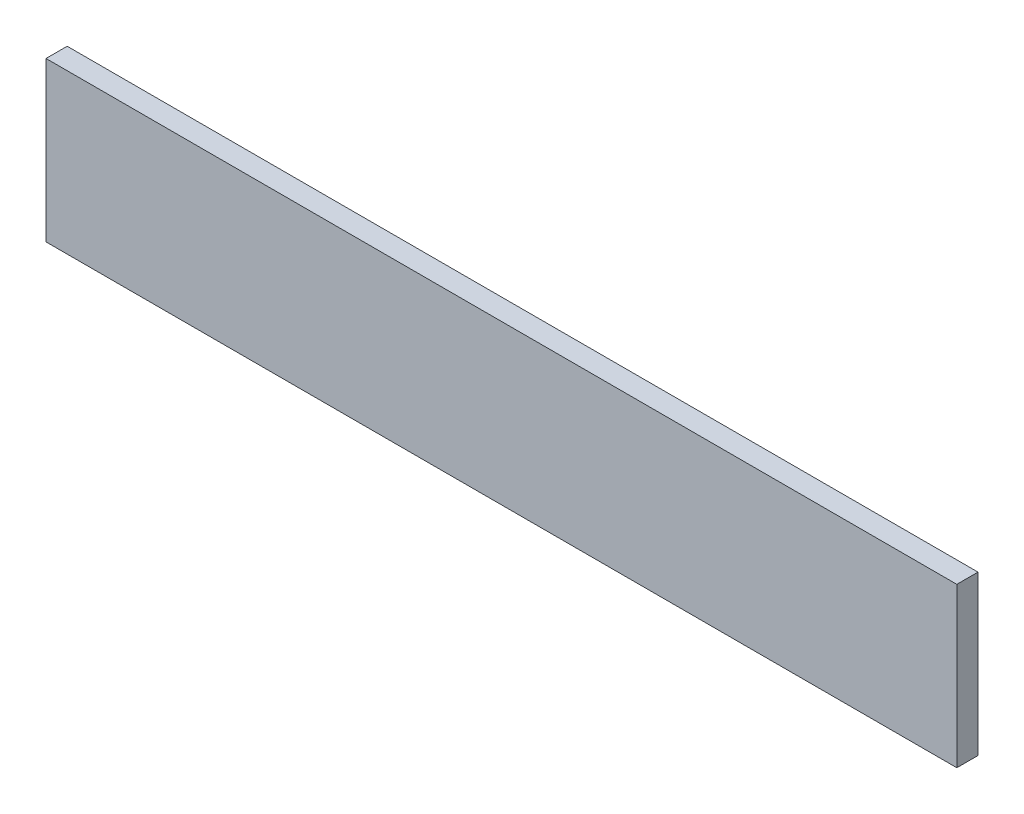
ISO-10303-21;
HEADER;
FILE_DESCRIPTION(('STEP AP214'),'2;1');
FILE_NAME('part.step','',(''),(''),'','','');
FILE_SCHEMA(('AUTOMOTIVE_DESIGN { 1 0 10303 214 1 1 1 1 }'));
ENDSEC;
DATA;
#1=APPLICATION_CONTEXT('core data for automotive mechanical design processes');
#2=APPLICATION_PROTOCOL_DEFINITION('international standard','automotive_design',2000,#1);
#3=PRODUCT_CONTEXT('',#1,'mechanical');
#4=PRODUCT('Part','Part','',(#3));
#5=PRODUCT_RELATED_PRODUCT_CATEGORY('part','',(#4));
#6=PRODUCT_DEFINITION_FORMATION('','',#4);
#7=PRODUCT_DEFINITION_CONTEXT('part definition',#1,'design');
#8=PRODUCT_DEFINITION('design','',#6,#7);
#9=PRODUCT_DEFINITION_SHAPE('','',#8);
#10=(LENGTH_UNIT() NAMED_UNIT(*) SI_UNIT(.MILLI.,.METRE.));
#11=(NAMED_UNIT(*) PLANE_ANGLE_UNIT() SI_UNIT($,.RADIAN.));
#12=(NAMED_UNIT(*) SI_UNIT($,.STERADIAN.) SOLID_ANGLE_UNIT());
#13=UNCERTAINTY_MEASURE_WITH_UNIT(LENGTH_MEASURE(1.E-05),#10,'distance_accuracy_value','');
#14=(GEOMETRIC_REPRESENTATION_CONTEXT(3) GLOBAL_UNCERTAINTY_ASSIGNED_CONTEXT((#13)) GLOBAL_UNIT_ASSIGNED_CONTEXT((#10,
#11,#12)) REPRESENTATION_CONTEXT('',''));
#15=CARTESIAN_POINT('',(0.,0.,0.));
#16=DIRECTION('',(0.,0.,1.));
#17=DIRECTION('',(1.,0.,0.));
#18=AXIS2_PLACEMENT_3D('',#15,#16,#17);
#19=CARTESIAN_POINT('',(-613.953092608063,236.823308270677,20.));
#20=DIRECTION('',(1.,0.,0.));
#21=DIRECTION('',(0.,0.,-1.));
#22=AXIS2_PLACEMENT_3D('',#19,#20,#21);
#23=PLANE('',#22);
#24=DIRECTION('',(0.,-1.,0.));
#25=VECTOR('',#24,1.);
#26=CARTESIAN_POINT('',(-613.953092608063,236.823308270677,0.));
#27=LINE('',#26,#25);
#28=CARTESIAN_POINT('',(-613.953092608063,236.823308270677,0.));
#29=VERTEX_POINT('',#28);
#30=CARTESIAN_POINT('',(-613.953092608063,86.8233082706766,0.));
#31=VERTEX_POINT('',#30);
#32=EDGE_CURVE('E96',#29,#31,#27,.T.);
#33=ORIENTED_EDGE('',*,*,#32,.T.);
#34=DIRECTION('',(0.,0.,-1.));
#35=VECTOR('',#34,1.);
#36=CARTESIAN_POINT('',(-613.953092608063,86.8233082706766,20.));
#37=LINE('',#36,#35);
#38=CARTESIAN_POINT('',(-613.953092608063,86.8233082706766,20.));
#39=VERTEX_POINT('',#38);
#40=EDGE_CURVE('E11',#39,#31,#37,.T.);
#41=ORIENTED_EDGE('',*,*,#40,.F.);
#42=DIRECTION('',(0.,-1.,0.));
#43=VECTOR('',#42,1.);
#44=CARTESIAN_POINT('',(-613.953092608063,236.823308270677,20.));
#45=LINE('',#44,#43);
#46=CARTESIAN_POINT('',(-613.953092608063,236.823308270677,20.));
#47=VERTEX_POINT('',#46);
#48=EDGE_CURVE('E84',#47,#39,#45,.T.);
#49=ORIENTED_EDGE('',*,*,#48,.F.);
#50=DIRECTION('',(0.,0.,-1.));
#51=VECTOR('',#50,1.);
#52=CARTESIAN_POINT('',(-613.953092608063,236.823308270677,20.));
#53=LINE('',#52,#51);
#54=EDGE_CURVE('E92',#47,#29,#53,.T.);
#55=ORIENTED_EDGE('',*,*,#54,.T.);
#56=EDGE_LOOP('',(#33,#41,#49,#55));
#57=FACE_BOUND('',#56,.T.);
#58=ADVANCED_FACE('F33',(#57),#23,.F.);
#59=CARTESIAN_POINT('',(-613.953092608063,86.8233082706766,20.));
#60=DIRECTION('',(0.,1.,0.));
#61=DIRECTION('',(0.,0.,1.));
#62=AXIS2_PLACEMENT_3D('',#59,#60,#61);
#63=PLANE('',#62);
#64=DIRECTION('',(1.,0.,0.));
#65=VECTOR('',#64,1.);
#66=CARTESIAN_POINT('',(-613.953092608063,86.8233082706766,0.));
#67=LINE('',#66,#65);
#68=CARTESIAN_POINT('',(246.046907391937,86.8233082706766,0.));
#69=VERTEX_POINT('',#68);
#70=EDGE_CURVE('E88',#31,#69,#67,.T.);
#71=ORIENTED_EDGE('',*,*,#70,.T.);
#72=DIRECTION('',(0.,0.,-1.));
#73=VECTOR('',#72,1.);
#74=CARTESIAN_POINT('',(246.046907391937,86.8233082706766,20.));
#75=LINE('',#74,#73);
#76=CARTESIAN_POINT('',(246.046907391937,86.8233082706766,20.));
#77=VERTEX_POINT('',#76);
#78=EDGE_CURVE('E41',#77,#69,#75,.T.);
#79=ORIENTED_EDGE('',*,*,#78,.F.);
#80=DIRECTION('',(1.,0.,0.));
#81=VECTOR('',#80,1.);
#82=CARTESIAN_POINT('',(-613.953092608063,86.8233082706766,20.));
#83=LINE('',#82,#81);
#84=EDGE_CURVE('E79',#39,#77,#83,.T.);
#85=ORIENTED_EDGE('',*,*,#84,.F.);
#86=ORIENTED_EDGE('',*,*,#40,.T.);
#87=EDGE_LOOP('',(#71,#79,#85,#86));
#88=FACE_BOUND('',#87,.T.);
#89=ADVANCED_FACE('F87',(#88),#63,.F.);
#90=CARTESIAN_POINT('',(246.046907391937,236.823308270677,20.));
#91=DIRECTION('',(-1.,0.,0.));
#92=DIRECTION('',(0.,-1.,0.));
#93=AXIS2_PLACEMENT_3D('',#90,#91,#92);
#94=PLANE('',#93);
#95=DIRECTION('',(0.,1.,0.));
#96=VECTOR('',#95,1.);
#97=CARTESIAN_POINT('',(246.046907391937,236.823308270677,0.));
#98=LINE('',#97,#96);
#99=CARTESIAN_POINT('',(246.046907391937,236.823308270677,0.));
#100=VERTEX_POINT('',#99);
#101=EDGE_CURVE('E66',#69,#100,#98,.T.);
#102=ORIENTED_EDGE('',*,*,#101,.T.);
#103=DIRECTION('',(0.,0.,-1.));
#104=VECTOR('',#103,1.);
#105=CARTESIAN_POINT('',(246.046907391937,236.823308270677,20.));
#106=LINE('',#105,#104);
#107=CARTESIAN_POINT('',(246.046907391937,236.823308270677,20.));
#108=VERTEX_POINT('',#107);
#109=EDGE_CURVE('E89',#108,#100,#106,.T.);
#110=ORIENTED_EDGE('',*,*,#109,.F.);
#111=DIRECTION('',(0.,1.,0.));
#112=VECTOR('',#111,1.);
#113=CARTESIAN_POINT('',(246.046907391937,236.823308270677,20.));
#114=LINE('',#113,#112);
#115=EDGE_CURVE('E82',#77,#108,#114,.T.);
#116=ORIENTED_EDGE('',*,*,#115,.F.);
#117=ORIENTED_EDGE('',*,*,#78,.T.);
#118=EDGE_LOOP('',(#102,#110,#116,#117));
#119=FACE_BOUND('',#118,.T.);
#120=ADVANCED_FACE('F90',(#119),#94,.F.);
#121=CARTESIAN_POINT('',(-613.953092608063,236.823308270677,20.));
#122=DIRECTION('',(0.,-1.,0.));
#123=DIRECTION('',(0.,0.,-1.));
#124=AXIS2_PLACEMENT_3D('',#121,#122,#123);
#125=PLANE('',#124);
#126=DIRECTION('',(-1.,0.,0.));
#127=VECTOR('',#126,1.);
#128=CARTESIAN_POINT('',(-613.953092608063,236.823308270677,0.));
#129=LINE('',#128,#127);
#130=EDGE_CURVE('E72',#100,#29,#129,.T.);
#131=ORIENTED_EDGE('',*,*,#130,.T.);
#132=ORIENTED_EDGE('',*,*,#54,.F.);
#133=DIRECTION('',(-1.,0.,0.));
#134=VECTOR('',#133,1.);
#135=CARTESIAN_POINT('',(-613.953092608063,236.823308270677,20.));
#136=LINE('',#135,#134);
#137=EDGE_CURVE('E49',#108,#47,#136,.T.);
#138=ORIENTED_EDGE('',*,*,#137,.F.);
#139=ORIENTED_EDGE('',*,*,#109,.T.);
#140=EDGE_LOOP('',(#131,#132,#138,#139));
#141=FACE_BOUND('',#140,.T.);
#142=ADVANCED_FACE('F103',(#141),#125,.F.);
#143=CARTESIAN_POINT('',(0.,0.,20.));
#144=DIRECTION('',(0.,0.,1.));
#145=DIRECTION('',(1.,0.,0.));
#146=AXIS2_PLACEMENT_3D('',#143,#144,#145);
#147=PLANE('',#146);
#148=ORIENTED_EDGE('',*,*,#48,.T.);
#149=ORIENTED_EDGE('',*,*,#84,.T.);
#150=ORIENTED_EDGE('',*,*,#115,.T.);
#151=ORIENTED_EDGE('',*,*,#137,.T.);
#152=EDGE_LOOP('',(#148,#149,#150,#151));
#153=FACE_BOUND('',#152,.T.);
#154=ADVANCED_FACE('F80',(#153),#147,.T.);
#155=CARTESIAN_POINT('',(0.,0.,0.));
#156=DIRECTION('',(0.,0.,1.));
#157=DIRECTION('',(1.,0.,0.));
#158=AXIS2_PLACEMENT_3D('',#155,#156,#157);
#159=PLANE('',#158);
#160=ORIENTED_EDGE('',*,*,#32,.F.);
#161=ORIENTED_EDGE('',*,*,#130,.F.);
#162=ORIENTED_EDGE('',*,*,#101,.F.);
#163=ORIENTED_EDGE('',*,*,#70,.F.);
#164=EDGE_LOOP('',(#160,#161,#162,#163));
#165=FACE_BOUND('',#164,.T.);
#166=ADVANCED_FACE('F106',(#165),#159,.F.);
#167=CLOSED_SHELL('',(#58,#89,#120,#142,#154,#166));
#168=MANIFOLD_SOLID_BREP('B2',#167);
#169=ADVANCED_BREP_SHAPE_REPRESENTATION('',(#18,#168),#14);
#170=SHAPE_DEFINITION_REPRESENTATION(#9,#169);
ENDSEC;
END-ISO-10303-21;
